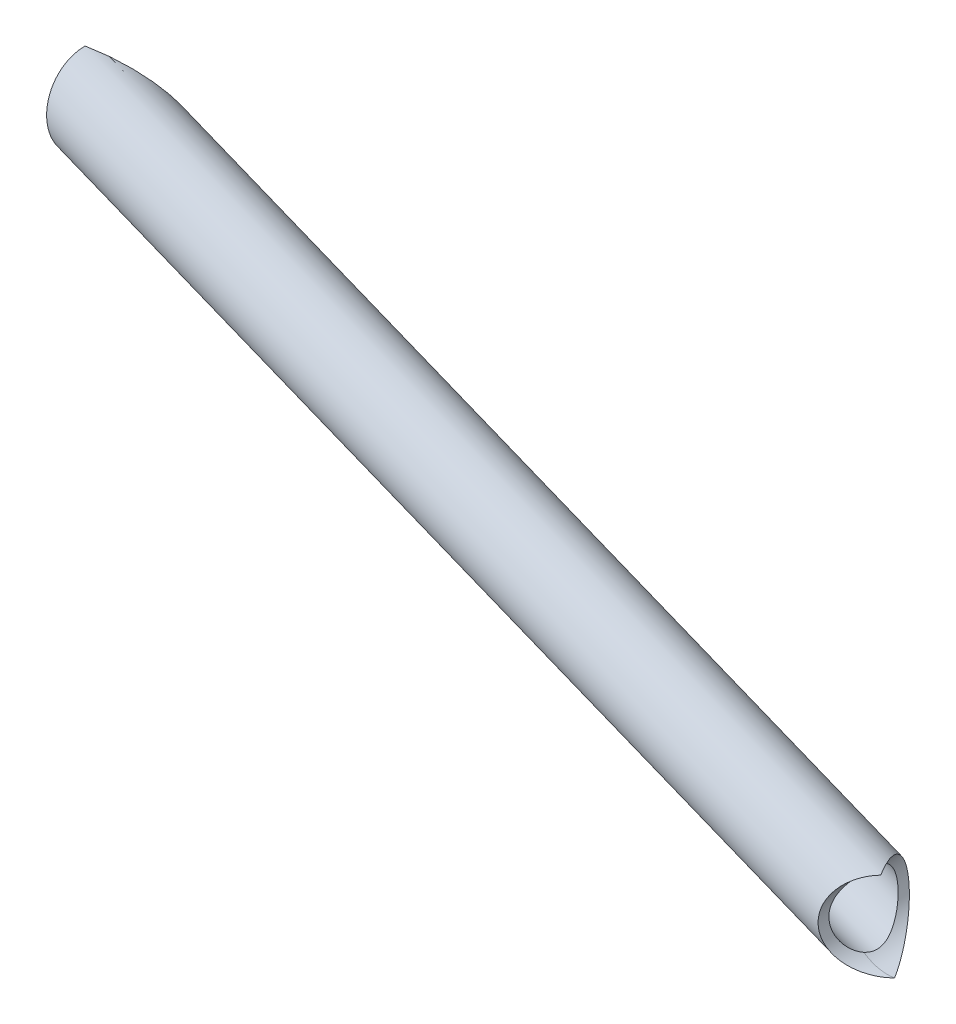
ISO-10303-21;
HEADER;
FILE_DESCRIPTION(('STEP AP214'),'2;1');
FILE_NAME('part.step','',(''),(''),'','','');
FILE_SCHEMA(('AUTOMOTIVE_DESIGN { 1 0 10303 214 1 1 1 1 }'));
ENDSEC;
DATA;
#1=APPLICATION_CONTEXT('core data for automotive mechanical design processes');
#2=APPLICATION_PROTOCOL_DEFINITION('international standard','automotive_design',2000,#1);
#3=PRODUCT_CONTEXT('',#1,'mechanical');
#4=PRODUCT('Part','Part','',(#3));
#5=PRODUCT_RELATED_PRODUCT_CATEGORY('part','',(#4));
#6=PRODUCT_DEFINITION_FORMATION('','',#4);
#7=PRODUCT_DEFINITION_CONTEXT('part definition',#1,'design');
#8=PRODUCT_DEFINITION('design','',#6,#7);
#9=PRODUCT_DEFINITION_SHAPE('','',#8);
#10=(LENGTH_UNIT() NAMED_UNIT(*) SI_UNIT(.MILLI.,.METRE.));
#11=(NAMED_UNIT(*) PLANE_ANGLE_UNIT() SI_UNIT($,.RADIAN.));
#12=(NAMED_UNIT(*) SI_UNIT($,.STERADIAN.) SOLID_ANGLE_UNIT());
#13=UNCERTAINTY_MEASURE_WITH_UNIT(LENGTH_MEASURE(1.E-05),#10,'distance_accuracy_value','');
#14=(GEOMETRIC_REPRESENTATION_CONTEXT(3) GLOBAL_UNCERTAINTY_ASSIGNED_CONTEXT((#13)) GLOBAL_UNIT_ASSIGNED_CONTEXT((#10,
#11,#12)) REPRESENTATION_CONTEXT('',''));
#15=CARTESIAN_POINT('',(0.,0.,0.));
#16=DIRECTION('',(0.,0.,1.));
#17=DIRECTION('',(1.,0.,0.));
#18=AXIS2_PLACEMENT_3D('',#15,#16,#17);
#19=CARTESIAN_POINT('',(900.,503.049546279118,167.449999999999));
#20=DIRECTION('',(-0.914545522624735,-0.155523085877016,-0.373388613653845));
#21=DIRECTION('',(-0.377987872602403,0.,0.925810546583646));
#22=AXIS2_PLACEMENT_3D('',#19,#20,#21);
#23=CYLINDRICAL_SURFACE('',#22,12.7);
#24=CARTESIAN_POINT('',(900.,503.049546279118,167.449999999999));
#25=DIRECTION('',(-0.816941933505309,-0.138925102510415,0.559737164366524));
#26=DIRECTION('',(-0.551815136060001,-0.0938389513377034,-0.828670203897137));
#27=AXIS2_PLACEMENT_3D('',#24,#25,#26);
#28=ELLIPSE('',#27,22.6892205994095,12.7);
#29=CARTESIAN_POINT('',(902.129132667718,490.52929092696,167.449999999999));
#30=VERTEX_POINT('',#29);
#31=CARTESIAN_POINT('',(897.870867332281,515.569801631277,167.449999999999));
#32=VERTEX_POINT('',#31);
#33=EDGE_CURVE('E87',#30,#32,#28,.F.);
#34=ORIENTED_EDGE('',*,*,#33,.F.);
#35=CARTESIAN_POINT('',(902.129132667718,490.52929092696,167.449999999999));
#36=CARTESIAN_POINT('',(902.122622527037,490.528183844689,167.454198455936));
#37=CARTESIAN_POINT('',(902.116111504246,490.527081459243,167.458396889795));
#38=CARTESIAN_POINT('',(901.661299132018,490.45041536341,167.751627534305));
#39=CARTESIAN_POINT('',(901.208847162959,490.397112413899,168.04054100451));
#40=CARTESIAN_POINT('',(900.299484677143,490.335760767951,168.616293994502));
#41=CARTESIAN_POINT('',(899.842572533139,490.32772925748,168.903132685398));
#42=CARTESIAN_POINT('',(898.926631418943,490.357934896545,169.473822874049));
#43=CARTESIAN_POINT('',(898.467600059604,490.396296410429,169.757664275964));
#44=CARTESIAN_POINT('',(897.552660406562,490.52075999025,170.319584412169));
#45=CARTESIAN_POINT('',(897.096750878394,490.606841932938,170.597665524278));
#46=CARTESIAN_POINT('',(896.283921842593,490.805769685706,171.090344072895));
#47=CARTESIAN_POINT('',(895.925668563482,490.90965400373,171.306384384694));
#48=CARTESIAN_POINT('',(895.216171297338,491.149540275628,171.732156637292));
#49=CARTESIAN_POINT('',(894.864927129832,491.285541401378,171.94188874059));
#50=CARTESIAN_POINT('',(894.172842247707,491.590176165168,172.353107853072));
#51=CARTESIAN_POINT('',(893.831983583372,491.758749311541,172.554609320319));
#52=CARTESIAN_POINT('',(893.163108244727,492.129355034394,172.947951310032));
#53=CARTESIAN_POINT('',(892.835089202271,492.33138140445,173.139793615926));
#54=CARTESIAN_POINT('',(892.254086847868,492.72908433124,173.477578121337));
#55=CARTESIAN_POINT('',(891.998378942181,492.919124407548,173.625483593816));
#56=CARTESIAN_POINT('',(891.4999444911,493.321753147347,173.912150115556));
#57=CARTESIAN_POINT('',(891.257215399974,493.534337364329,174.050912959349));
#58=CARTESIAN_POINT('',(890.786938932366,493.981808619295,174.317903503734));
#59=CARTESIAN_POINT('',(890.559391735893,494.216695921644,174.446131079414));
#60=CARTESIAN_POINT('',(890.121833183771,494.708139912072,174.690540454786));
#61=CARTESIAN_POINT('',(889.911822108782,494.964696946834,174.806722061695));
#62=CARTESIAN_POINT('',(889.510236955432,495.500401226087,175.026297197397));
#63=CARTESIAN_POINT('',(889.318813416184,495.779703855027,175.129587978495));
#64=CARTESIAN_POINT('',(888.95860792515,496.357569203389,175.320772835931));
#65=CARTESIAN_POINT('',(888.789826307408,496.65613220687,175.40866668512));
#66=CARTESIAN_POINT('',(888.477224114984,497.270110105648,175.567529235537));
#67=CARTESIAN_POINT('',(888.333387301978,497.585513861869,175.638508958702));
#68=CARTESIAN_POINT('',(888.072437140031,498.230598909394,175.762341295895));
#69=CARTESIAN_POINT('',(887.955319983527,498.560278158459,175.815196493217));
#70=CARTESIAN_POINT('',(887.762409272802,499.187798586848,175.89627615038));
#71=CARTESIAN_POINT('',(887.683245575699,499.484315569086,175.926786943619));
#72=CARTESIAN_POINT('',(887.546899187133,500.083481602296,175.972885213894));
#73=CARTESIAN_POINT('',(887.489714330709,500.386130046214,175.988474160989));
#74=CARTESIAN_POINT('',(887.397593601685,500.995121831296,176.004540111915));
#75=CARTESIAN_POINT('',(887.362653553058,501.301464467938,176.005019953005));
#76=CARTESIAN_POINT('',(887.314929652733,501.915520464499,175.990916470395));
#77=CARTESIAN_POINT('',(887.302145963986,502.223233834482,175.976333035913));
#78=CARTESIAN_POINT('',(887.29842517406,502.82565048861,175.93322311519));
#79=CARTESIAN_POINT('',(887.306650429231,503.120390442243,175.905266258473));
#80=CARTESIAN_POINT('',(887.342624992098,503.707082390096,175.836075759905));
#81=CARTESIAN_POINT('',(887.370373506881,503.999034497053,175.794842657288));
#82=CARTESIAN_POINT('',(887.444647974888,504.578437265887,175.699612322176));
#83=CARTESIAN_POINT('',(887.491175222671,504.865887616004,175.645614209797));
#84=CARTESIAN_POINT('',(887.602129826446,505.434739926397,175.525464868647));
#85=CARTESIAN_POINT('',(887.666559078194,505.716141242701,175.45931235302));
#86=CARTESIAN_POINT('',(887.817865353703,506.29252311627,175.310097862798));
#87=CARTESIAN_POINT('',(887.906071350084,506.586921595353,175.226135532974));
#88=CARTESIAN_POINT('',(888.100808217771,507.165680403899,175.045839560192));
#89=CARTESIAN_POINT('',(888.207339802163,507.450040342223,174.949505435859));
#90=CARTESIAN_POINT('',(888.437457923756,508.007553820313,174.745376245834));
#91=CARTESIAN_POINT('',(888.561046744315,508.280705853378,174.637579646168));
#92=CARTESIAN_POINT('',(888.824037826602,508.814857363497,174.411425357395));
#93=CARTESIAN_POINT('',(888.96344592924,509.075852301322,174.293063770872));
#94=CARTESIAN_POINT('',(889.277309284251,509.620331604221,174.029503350167));
#95=CARTESIAN_POINT('',(889.453940293249,509.901868947411,173.882864714691));
#96=CARTESIAN_POINT('',(889.824380945655,510.447063200639,173.578366631511));
#97=CARTESIAN_POINT('',(890.018197061927,510.710713306786,173.420502960308));
#98=CARTESIAN_POINT('',(890.623025880253,511.473687796183,172.931887315737));
#99=CARTESIAN_POINT('',(891.057494571499,511.945165582597,172.586047418827));
#100=CARTESIAN_POINT('',(892.048749340857,512.876593746906,171.807065483814));
#101=CARTESIAN_POINT('',(892.614027407438,513.32308335057,171.36874556503));
#102=CARTESIAN_POINT('',(893.795916698795,514.105727293516,170.463901611869));
#103=CARTESIAN_POINT('',(894.412528096342,514.441881261426,169.997377482567));
#104=CARTESIAN_POINT('',(895.499277982196,514.920119523027,169.18519795424));
#105=CARTESIAN_POINT('',(895.960355441554,515.090214064727,168.843499306014));
#106=CARTESIAN_POINT('',(896.896339096839,515.3720931315,168.156052534914));
#107=CARTESIAN_POINT('',(897.371223250566,515.483965732568,167.81031134242));
#108=CARTESIAN_POINT('',(897.857378162866,515.567501754868,167.459725628872));
#109=CARTESIAN_POINT('',(897.86412230349,515.568654611534,167.454862809429));
#110=CARTESIAN_POINT('',(897.870867332281,515.569801631277,167.449999999999));
#111=B_SPLINE_CURVE_WITH_KNOTS('',3,(#35,#36,#37,#38,#39,#40,#41,#42,#43,#44,#45,#46,#47,#48,
#49,#50,#51,#52,#53,#54,#55,#56,#57,#58,#59,#60,#61,#62,#63,#64,#65,#66,#67,#68,#69,#70,#71,#72,
#73,#74,#75,#76,#77,#78,#79,#80,#81,#82,#83,#84,#85,#86,#87,#88,#89,#90,#91,#92,#93,#94,#95,#96,
#97,#98,#99,#100,#101,#102,#103,#104,#105,#106,#107,#108,#109,#110),.UNSPECIFIED.,.F.,.F.,(4,2,
2,2,2,2,2,2,2,2,2,2,2,2,2,2,2,2,2,2,2,2,2,2,2,2,2,2,2,2,2,2,2,2,2,2,2,4),(0.,0.0234759311194202,
1.63963604782687,3.25640965072118,4.87752691239777,6.49796108383418,7.78994422334894,
9.08189405307033,10.3714671864165,11.6608013386846,12.7135619076379,13.7661152194769,
14.8186810090961,15.8712636413793,16.9317625084439,17.9922770196716,19.0520985548112,
20.1117689704603,21.0358418001486,21.9598235833632,22.8836318558748,23.8074469225797,
24.6950084902585,25.5825340128319,26.4701207297598,27.357801474689,28.3126018825566,
29.2674394520615,30.2224049646076,31.1777242308237,32.2664105191893,33.355508623433,
35.5332220114024,38.0532389822262,40.5732644349785,42.3663045735679,44.1566243247933,
44.1818063663016),.UNSPECIFIED.);
#112=EDGE_CURVE('E88',#32,#30,#111,.F.);
#113=ORIENTED_EDGE('',*,*,#112,.F.);
#114=EDGE_LOOP('',(#34,#113));
#115=FACE_BOUND('',#114,.T.);
#116=CARTESIAN_POINT('',(489.862566335555,433.303603907535,-2.27595720048157E-12));
#117=DIRECTION('',(0.,0.,-1.));
#118=DIRECTION('',(-0.985846878122719,-0.16764824155263,0.));
#119=AXIS2_PLACEMENT_3D('',#116,#117,#118);
#120=ELLIPSE('',#119,34.0128207866932,12.7);
#121=CARTESIAN_POINT('',(487.733433667837,445.823859259693,-2.27595720048157E-12));
#122=VERTEX_POINT('',#121);
#123=CARTESIAN_POINT('',(491.991699003274,420.783348555376,-2.27595720048157E-12));
#124=VERTEX_POINT('',#123);
#125=EDGE_CURVE('E11',#122,#124,#120,.T.);
#126=ORIENTED_EDGE('',*,*,#125,.F.);
#127=CARTESIAN_POINT('',(489.862566335555,433.303603907535,-2.27595720048157E-12));
#128=DIRECTION('',(-0.985846878122719,-0.16764824155263,0.));
#129=DIRECTION('',(0.,0.,-1.));
#130=AXIS2_PLACEMENT_3D('',#127,#128,#129);
#131=ELLIPSE('',#130,13.6901390279901,12.7);
#132=EDGE_CURVE('E52',#124,#122,#131,.T.);
#133=ORIENTED_EDGE('',*,*,#132,.F.);
#134=EDGE_LOOP('',(#126,#133));
#135=FACE_BOUND('',#134,.T.);
#136=ADVANCED_FACE('F42',(#115,#135),#23,.T.);
#137=CARTESIAN_POINT('',(900.,420.499546279117,167.449999999999));
#138=DIRECTION('',(-1.,0.,0.));
#139=DIRECTION('',(0.,0.,1.));
#140=AXIS2_PLACEMENT_3D('',#137,#138,#139);
#141=TOROIDAL_SURFACE('',#140,82.5500000000008,12.7);
#142=CARTESIAN_POINT('',(900.,503.049546279118,167.449999999999));
#143=DIRECTION('',(0.,0.,-1.));
#144=DIRECTION('',(-1.,0.,0.));
#145=AXIS2_PLACEMENT_3D('',#142,#143,#144);
#146=CIRCLE('',#145,12.7);
#147=CARTESIAN_POINT('',(889.707055664031,510.488988253933,167.449999999999));
#148=VERTEX_POINT('',#147);
#149=EDGE_CURVE('E79',#148,#32,#146,.T.);
#150=ORIENTED_EDGE('',*,*,#149,.T.);
#151=ORIENTED_EDGE('',*,*,#112,.T.);
#152=CARTESIAN_POINT('',(892.744756187759,492.62594626641,167.449999999999));
#153=VERTEX_POINT('',#152);
#154=EDGE_CURVE('E82',#30,#153,#146,.T.);
#155=ORIENTED_EDGE('',*,*,#154,.T.);
#156=CARTESIAN_POINT('',(889.707121764974,510.489079707743,167.449799999999));
#157=CARTESIAN_POINT('',(889.67008511259,510.437838400286,167.561869968516));
#158=CARTESIAN_POINT('',(889.631870926055,510.383952087896,167.672307172637));
#159=CARTESIAN_POINT('',(889.553497677238,510.27108768359,167.8898056604));
#160=CARTESIAN_POINT('',(889.513339065407,510.21211076852,167.996867716538));
#161=CARTESIAN_POINT('',(889.390670662329,510.02800755622,168.312553010159));
#162=CARTESIAN_POINT('',(889.30584295024,509.895537794002,168.516047155908));
#163=CARTESIAN_POINT('',(889.133652971057,509.613471622576,168.907777024132));
#164=CARTESIAN_POINT('',(889.046305582128,509.463964620117,169.096084282118));
#165=CARTESIAN_POINT('',(888.871424254841,509.14875938673,169.458641236342));
#166=CARTESIAN_POINT('',(888.783890258369,508.983055046362,169.632885582626));
#167=CARTESIAN_POINT('',(888.611594863405,508.637827478004,169.966441441058));
#168=CARTESIAN_POINT('',(888.526821456761,508.458380235158,170.125825593605));
#169=CARTESIAN_POINT('',(888.36172064306,508.086227707166,170.430751024282));
#170=CARTESIAN_POINT('',(888.281392696442,507.893524037398,170.576293983916));
#171=CARTESIAN_POINT('',(888.126934261045,507.495733598871,170.853814686475));
#172=CARTESIAN_POINT('',(888.052813799435,507.290627682644,170.985770557687));
#173=CARTESIAN_POINT('',(887.912594507022,506.869489767067,171.235812467442));
#174=CARTESIAN_POINT('',(887.846496347657,506.653456855308,171.353897345007));
#175=CARTESIAN_POINT('',(887.717714013774,506.189611889411,171.587150975649));
#176=CARTESIAN_POINT('',(887.656029655031,505.940780492514,171.700851357647));
#177=CARTESIAN_POINT('',(887.546002308917,505.433066302126,171.91101385785));
#178=CARTESIAN_POINT('',(887.497660098884,505.174182923989,172.007474971549));
#179=CARTESIAN_POINT('',(887.415912003329,504.648321341008,172.182757511855));
#180=CARTESIAN_POINT('',(887.382499922925,504.381346542688,172.261586247782));
#181=CARTESIAN_POINT('',(887.331921848897,503.841222956981,172.401263217537));
#182=CARTESIAN_POINT('',(887.314754941307,503.568074517814,172.462112462771));
#183=CARTESIAN_POINT('',(887.297993122068,503.026391777352,172.563857815952));
#184=CARTESIAN_POINT('',(887.297865828654,502.757980046967,172.605318057343));
#185=CARTESIAN_POINT('',(887.314535142293,502.219546541041,172.67077154422));
#186=CARTESIAN_POINT('',(887.331331529629,501.949524786448,172.694765016464));
#187=CARTESIAN_POINT('',(887.382205107885,501.410204636176,172.725129786164));
#188=CARTESIAN_POINT('',(887.416276539668,501.140906029474,172.731506951959));
#189=CARTESIAN_POINT('',(887.501712961963,500.605232452332,172.726643353113));
#190=CARTESIAN_POINT('',(887.553077016702,500.338857324497,172.715403541676));
#191=CARTESIAN_POINT('',(887.668670965838,499.829226046247,172.676809959621));
#192=CARTESIAN_POINT('',(887.731788967836,499.585629199174,172.650603473759));
#193=CARTESIAN_POINT('',(887.872161910616,499.104668626731,172.583243387153));
#194=CARTESIAN_POINT('',(887.949416105228,498.867304573123,172.54209057523));
#195=CARTESIAN_POINT('',(888.117210365357,498.40046249658,172.445170197452));
#196=CARTESIAN_POINT('',(888.207747196615,498.170982570639,172.389406186764));
#197=CARTESIAN_POINT('',(888.401053071856,497.721267499313,172.263640929023));
#198=CARTESIAN_POINT('',(888.50382238152,497.501032554862,172.193639372718));
#199=CARTESIAN_POINT('',(888.720701208146,497.070264308765,172.039530883197));
#200=CARTESIAN_POINT('',(888.834850136311,496.859768700349,171.955374182614));
#201=CARTESIAN_POINT('',(889.07269736572,496.450352008834,171.773524906689));
#202=CARTESIAN_POINT('',(889.196395703014,496.251430969436,171.675832280246));
#203=CARTESIAN_POINT('',(889.451867103633,495.865717566726,171.467093699098));
#204=CARTESIAN_POINT('',(889.583651028092,495.678942243739,171.356029581369));
#205=CARTESIAN_POINT('',(889.853310184359,495.31845806957,171.120872139577));
#206=CARTESIAN_POINT('',(889.991185549313,495.144749504226,170.996778530635));
#207=CARTESIAN_POINT('',(890.282325478391,494.797388188149,170.725066561243));
#208=CARTESIAN_POINT('',(890.435933233347,494.624874508767,170.576357504072));
#209=CARTESIAN_POINT('',(890.745064943452,494.296129406211,170.263611352127));
#210=CARTESIAN_POINT('',(890.900589316018,494.139901602577,170.099570865238));
#211=CARTESIAN_POINT('',(891.209735360029,493.844596846178,169.756270733527));
#212=CARTESIAN_POINT('',(891.363361294627,493.705470598083,169.577057472524));
#213=CARTESIAN_POINT('',(891.665147214922,493.444296629812,169.20249847375));
#214=CARTESIAN_POINT('',(891.813310196045,493.322239444684,169.007161772905));
#215=CARTESIAN_POINT('',(892.102279375522,493.093360888919,168.595657744687));
#216=CARTESIAN_POINT('',(892.242892565157,492.986872668086,168.379165417414));
#217=CARTESIAN_POINT('',(892.441498029712,492.841047194101,168.040952431166));
#218=CARTESIAN_POINT('',(892.505708717826,492.794714975542,167.925840366526));
#219=CARTESIAN_POINT('',(892.629197261375,492.706750232598,167.691145682434));
#220=CARTESIAN_POINT('',(892.688471544189,492.665121104341,167.571559914399));
#221=CARTESIAN_POINT('',(892.744848802594,492.625881803102,167.449799999999));
#222=B_SPLINE_CURVE_WITH_KNOTS('',3,(#156,#157,#158,#159,#160,#161,#162,#163,#164,#165,#166,
#167,#168,#169,#170,#171,#172,#173,#174,#175,#176,#177,#178,#179,#180,#181,#182,#183,#184,#185,
#186,#187,#188,#189,#190,#191,#192,#193,#194,#195,#196,#197,#198,#199,#200,#201,#202,#203,#204,
#205,#206,#207,#208,#209,#210,#211,#212,#213,#214,#215,#216,#217,#218,#219,#220,#221),
.UNSPECIFIED.,.F.,.F.,(4,2,2,2,2,2,2,2,2,2,2,2,2,2,2,2,2,2,2,2,2,2,2,2,2,2,2,2,2,2,2,2,4),(0.,
0.385927151135696,0.771765321265045,1.54216325141601,2.30868991508118,3.07550682730649,
3.83835374748479,4.60110787411809,5.36507124924067,6.12909852134163,6.96941066299186,
7.80977175240325,8.64978383056243,9.48974864624745,10.303463469471,11.1171677285962,
11.9306008940799,12.7439900484887,13.5020889044225,14.2601477560613,15.0180223294308,
15.7759133662775,16.5365269732377,17.2971434517919,18.058805016401,18.8204832375353,
19.643718078679,20.4671354956616,21.2881207923811,22.1086490246216,22.9447510527091,
23.363687457079,23.7829244698475),.UNSPECIFIED.);
#223=EDGE_CURVE('E76',#148,#153,#222,.T.);
#224=ORIENTED_EDGE('',*,*,#223,.F.);
#225=EDGE_LOOP('',(#150,#151,#155,#224));
#226=FACE_BOUND('',#225,.T.);
#227=ADVANCED_FACE('F78',(#226),#141,.F.);
#228=CARTESIAN_POINT('',(900.,503.049546279118,167.449999999999));
#229=DIRECTION('',(0.,0.,-1.));
#230=DIRECTION('',(-1.,0.,0.));
#231=AXIS2_PLACEMENT_3D('',#228,#229,#230);
#232=CYLINDRICAL_SURFACE('',#231,12.7);
#233=ORIENTED_EDGE('',*,*,#154,.F.);
#234=ORIENTED_EDGE('',*,*,#33,.T.);
#235=ORIENTED_EDGE('',*,*,#149,.F.);
#236=CARTESIAN_POINT('',(887.391748247447,501.525739288637,172.725629836838));
#237=CARTESIAN_POINT('',(887.422507809845,501.271227086945,172.738188507595));
#238=CARTESIAN_POINT('',(887.461032357995,501.01726638347,172.742853874987));
#239=CARTESIAN_POINT('',(887.553374172634,500.512349291848,172.736363748303));
#240=CARTESIAN_POINT('',(887.607191116358,500.261392840409,172.72520858812));
#241=CARTESIAN_POINT('',(887.729595903643,499.764321291795,172.687161663404));
#242=CARTESIAN_POINT('',(887.798184056515,499.518206296119,172.660269569318));
#243=CARTESIAN_POINT('',(887.949339146732,499.032550735458,172.590942868691));
#244=CARTESIAN_POINT('',(888.03190621441,498.793010231796,172.54850811723));
#245=CARTESIAN_POINT('',(888.209797069173,498.322578700214,172.448485002969));
#246=CARTESIAN_POINT('',(888.305093474673,498.091670431655,172.390928917058));
#247=CARTESIAN_POINT('',(888.507344035722,497.639348738015,172.260958693294));
#248=CARTESIAN_POINT('',(888.614298178502,497.417935302534,172.188544571714));
#249=CARTESIAN_POINT('',(888.838483642341,496.985732834522,172.029194320065));
#250=CARTESIAN_POINT('',(888.955717441454,496.774946383165,171.94225468382));
#251=CARTESIAN_POINT('',(889.198879295757,496.365042954308,171.754199991029));
#252=CARTESIAN_POINT('',(889.324807557176,496.165926253814,171.653084598185));
#253=CARTESIAN_POINT('',(889.588932193971,495.772314713037,171.432548034823));
#254=CARTESIAN_POINT('',(889.727419386818,495.578338896465,171.312548794346));
#255=CARTESIAN_POINT('',(890.00988010488,495.204652065362,171.057693454642));
#256=CARTESIAN_POINT('',(890.153853999096,495.024942012768,170.922836355013));
#257=CARTESIAN_POINT('',(890.445043510564,494.680333962115,170.638270688677));
#258=CARTESIAN_POINT('',(890.592260603071,494.515442885623,170.488555250011));
#259=CARTESIAN_POINT('',(890.887284268931,494.201108378058,170.174245304981));
#260=CARTESIAN_POINT('',(891.035090776406,494.051663268219,170.009652419244));
#261=CARTESIAN_POINT('',(891.311605730341,493.784860673694,169.685021355621));
#262=CARTESIAN_POINT('',(891.44056826495,493.665787690161,169.526607948409));
#263=CARTESIAN_POINT('',(891.694305903732,493.440476466362,169.197711727309));
#264=CARTESIAN_POINT('',(891.819080997294,493.334238258618,169.027228882842));
#265=CARTESIAN_POINT('',(892.061578090449,493.135110322839,168.674303708937));
#266=CARTESIAN_POINT('',(892.179310039079,493.042201493295,168.491879050142));
#267=CARTESIAN_POINT('',(892.404886019399,492.869940110478,168.114908204068));
#268=CARTESIAN_POINT('',(892.512732481348,492.790584221171,167.920365015881));
#269=CARTESIAN_POINT('',(892.69571139016,492.659768961861,167.558366203399));
#270=CARTESIAN_POINT('',(892.773137624438,492.605882368504,167.392944497937));
#271=CARTESIAN_POINT('',(892.917745695898,492.507282050377,167.055052841455));
#272=CARTESIAN_POINT('',(892.984929816884,492.462566279911,166.882584472619));
#273=CARTESIAN_POINT('',(893.107456641245,492.382390550169,166.531623223232));
#274=CARTESIAN_POINT('',(893.162813069603,492.346919852183,166.353137606818));
#275=CARTESIAN_POINT('',(893.260588679331,492.285082079779,165.991107001709));
#276=CARTESIAN_POINT('',(893.303007768464,492.258715070268,165.807561976952));
#277=CARTESIAN_POINT('',(893.374225888216,492.214839414525,165.43673509255));
#278=CARTESIAN_POINT('',(893.403019493805,492.197334296491,165.24945177537));
#279=CARTESIAN_POINT('',(893.446850173174,492.170810922791,164.872705292186));
#280=CARTESIAN_POINT('',(893.461887276453,492.161792648927,164.683242130857));
#281=CARTESIAN_POINT('',(893.478656509395,492.151740394171,164.303358733076));
#282=CARTESIAN_POINT('',(893.48037599758,492.150713999403,164.112937758922));
#283=CARTESIAN_POINT('',(893.471357420701,492.156115270638,163.732479160727));
#284=CARTESIAN_POINT('',(893.460615538174,492.162545220845,163.542441672034));
#285=CARTESIAN_POINT('',(893.420284574977,492.186850355667,163.076940739934));
#286=CARTESIAN_POINT('',(893.3843157173,492.208619314958,162.802225280082));
#287=CARTESIAN_POINT('',(893.292182422369,492.265388315617,162.257597583221));
#288=CARTESIAN_POINT('',(893.236007701561,492.300395094696,161.987687865584));
#289=CARTESIAN_POINT('',(893.106977052367,492.382676951284,161.45287005017));
#290=CARTESIAN_POINT('',(893.034065162668,492.429993258527,161.187982033853));
#291=CARTESIAN_POINT('',(892.874921593875,492.536107420122,160.664650790592));
#292=CARTESIAN_POINT('',(892.788690501205,492.594904769012,160.406207280488));
#293=CARTESIAN_POINT('',(892.624987968737,492.70996303891,159.949999848184));
#294=CARTESIAN_POINT('',(892.549527494635,492.764125183132,159.750974052673));
#295=CARTESIAN_POINT('',(892.393088005877,492.879279363254,159.357102057013));
#296=CARTESIAN_POINT('',(892.312108388179,492.940272145966,159.16225631666));
#297=CARTESIAN_POINT('',(892.062262172523,493.133567235948,158.583900853917));
#298=CARTESIAN_POINT('',(891.886539665976,493.276151080477,158.206712520718));
#299=CARTESIAN_POINT('',(891.523241085339,493.589516791053,157.470650829774));
#300=CARTESIAN_POINT('',(891.335673264066,493.760279155601,157.111765028704));
#301=CARTESIAN_POINT('',(890.953582818782,494.131958925234,156.414025912199));
#302=CARTESIAN_POINT('',(890.759064542891,494.332857720497,156.0751604126));
#303=CARTESIAN_POINT('',(890.432718229692,494.695193903927,155.529528317995));
#304=CARTESIAN_POINT('',(890.301550172659,494.847542618463,155.316301519872));
#305=CARTESIAN_POINT('',(890.039520175467,495.167816388646,154.901609483533));
#306=CARTESIAN_POINT('',(889.908658238427,495.335741602277,154.700144364643));
#307=CARTESIAN_POINT('',(889.64901682159,495.687829362649,154.311193396801));
#308=CARTESIAN_POINT('',(889.520234049807,495.871962476599,154.123683304423));
#309=CARTESIAN_POINT('',(889.266366346894,496.257460177636,153.76475317242));
#310=CARTESIAN_POINT('',(889.141280223247,496.458819124299,153.593327904241));
#311=CARTESIAN_POINT('',(888.840109348596,496.977205751493,153.194344358851));
#312=CARTESIAN_POINT('',(888.667182866267,497.304670903765,152.977475184358));
#313=CARTESIAN_POINT('',(888.423165008414,497.824265056096,152.691605910152));
#314=CARTESIAN_POINT('',(888.344399188734,498.002164798994,152.602899718656));
#315=CARTESIAN_POINT('',(888.193054290885,498.367132756224,152.440148891822));
#316=CARTESIAN_POINT('',(888.120474122675,498.554199345974,152.36610167021));
#317=CARTESIAN_POINT('',(887.994001139313,498.905286251494,152.245108314629));
#318=CARTESIAN_POINT('',(887.93899455761,499.068063489711,152.195709818075));
#319=CARTESIAN_POINT('',(887.834841238723,499.398665870607,152.109182129323));
#320=CARTESIAN_POINT('',(887.785693344339,499.566490008201,152.072050511613));
#321=CARTESIAN_POINT('',(887.693901994512,499.906158909981,152.010794575845));
#322=CARTESIAN_POINT('',(887.65125525067,500.07800159044,151.986663666037));
#323=CARTESIAN_POINT('',(887.572957274896,500.424631817434,151.951890963221));
#324=CARTESIAN_POINT('',(887.537306119776,500.599419396281,151.941249318322));
#325=CARTESIAN_POINT('',(887.473312963667,500.950954495013,151.933685322012));
#326=CARTESIAN_POINT('',(887.444984450641,501.127705014971,151.936788099267));
#327=CARTESIAN_POINT('',(887.395910687517,501.481481734953,151.956700313217));
#328=CARTESIAN_POINT('',(887.375165459978,501.658507935796,151.973509790687));
#329=CARTESIAN_POINT('',(887.341245010061,502.011572366534,152.020476418756));
#330=CARTESIAN_POINT('',(887.328072788248,502.187610177493,152.050638851676));
#331=CARTESIAN_POINT('',(887.309120978138,502.537415440387,152.123689495969));
#332=CARTESIAN_POINT('',(887.303341539377,502.711182846327,152.166577964734));
#333=CARTESIAN_POINT('',(887.29886802536,503.052876340702,152.263553210117));
#334=CARTESIAN_POINT('',(887.300070915269,503.220850760697,152.317465871642));
#335=CARTESIAN_POINT('',(887.308888843496,503.552834625752,152.435989608102));
#336=CARTESIAN_POINT('',(887.316505890181,503.716842812379,152.500604028823));
#337=CARTESIAN_POINT('',(887.34823865028,504.201855167958,152.709079466827));
#338=CARTESIAN_POINT('',(887.381234683965,504.516021667352,152.867623651888));
#339=CARTESIAN_POINT('',(887.493194986359,505.311633396405,153.325140155141));
#340=CARTESIAN_POINT('',(887.587979490826,505.775866328229,153.650193186642));
#341=CARTESIAN_POINT('',(887.755647959707,506.428393463023,154.182438088262));
#342=CARTESIAN_POINT('',(887.815931394525,506.638973368752,154.367710187823));
#343=CARTESIAN_POINT('',(887.943273695504,507.045886266123,154.751214154267));
#344=CARTESIAN_POINT('',(888.010332220401,507.242219974496,154.949445368217));
#345=CARTESIAN_POINT('',(888.183045837875,507.712053533998,155.45514591085));
#346=CARTESIAN_POINT('',(888.291750064781,507.977241649601,155.769292382752));
#347=CARTESIAN_POINT('',(888.515498667426,508.478312110986,156.418179365104));
#348=CARTESIAN_POINT('',(888.63054676991,508.714176960089,156.752931994487));
#349=CARTESIAN_POINT('',(888.862318998036,509.157294654533,157.440602622702));
#350=CARTESIAN_POINT('',(888.979044169845,509.364528700842,157.793532349862));
#351=CARTESIAN_POINT('',(889.209073186897,509.750007592942,158.515784801085));
#352=CARTESIAN_POINT('',(889.32237860617,509.928265946505,158.885099783931));
#353=CARTESIAN_POINT('',(889.506416898931,510.204489348538,159.523874142356));
#354=CARTESIAN_POINT('',(889.579556804201,510.310321227577,159.78925774993));
#355=CARTESIAN_POINT('',(889.719016631767,510.506479651688,160.327520109598));
#356=CARTESIAN_POINT('',(889.785336215836,510.596805427946,160.600399232552));
#357=CARTESIAN_POINT('',(889.908190943199,510.760306687152,161.152735686703));
#358=CARTESIAN_POINT('',(889.964748354585,510.833521340459,161.432176349652));
#359=CARTESIAN_POINT('',(890.064933492275,510.960997075915,161.997635354888));
#360=CARTESIAN_POINT('',(890.108566658149,511.015266133627,162.283650875166));
#361=CARTESIAN_POINT('',(890.168452940393,511.088961248926,162.773321636147));
#362=CARTESIAN_POINT('',(890.188996866831,511.113963555245,162.975615970888));
#363=CARTESIAN_POINT('',(890.220713213514,511.152396578582,163.382010057824));
#364=CARTESIAN_POINT('',(890.231888726657,511.165831114634,163.586109191675));
#365=CARTESIAN_POINT('',(890.243691846539,511.180016381857,163.994793252976));
#366=CARTESIAN_POINT('',(890.244334647561,511.180785384086,164.199377054755));
#367=CARTESIAN_POINT('',(890.234233230751,511.168651414592,164.6078860796));
#368=CARTESIAN_POINT('',(890.223489361528,511.155748861431,164.811811322636));
#369=CARTESIAN_POINT('',(890.190094249479,511.115303785451,165.218939522297));
#370=CARTESIAN_POINT('',(890.167346483871,511.087642568591,165.422122981025));
#371=CARTESIAN_POINT('',(890.110156750172,511.017171509798,165.824177910326));
#372=CARTESIAN_POINT('',(890.075714752598,510.974361629674,166.023049370028));
#373=CARTESIAN_POINT('',(889.996071055564,510.873581016885,166.414861779757));
#374=CARTESIAN_POINT('',(889.950860961843,510.815598452868,166.60779796979));
#375=CARTESIAN_POINT('',(889.851230717434,510.684938826345,166.986147601369));
#376=CARTESIAN_POINT('',(889.796810428833,510.612261543797,167.171560930216));
#377=CARTESIAN_POINT('',(889.68620646915,510.460591321104,167.516532636032));
#378=CARTESIAN_POINT('',(889.630689818906,510.382868166849,167.676867338493));
#379=CARTESIAN_POINT('',(889.515130852974,510.216679714694,167.990193960696));
#380=CARTESIAN_POINT('',(889.455086864969,510.128210439922,168.143183132637));
#381=CARTESIAN_POINT('',(889.270374447396,509.847706167312,168.590774580145));
#382=CARTESIAN_POINT('',(889.141072704046,509.640504800504,168.874157460479));
#383=CARTESIAN_POINT('',(888.932586111129,509.280676419116,169.303701208481));
#384=CARTESIAN_POINT('',(888.853901235294,509.139076296238,169.45964667874));
#385=CARTESIAN_POINT('',(888.697766316238,508.844138874717,169.760777190185));
#386=CARTESIAN_POINT('',(888.620316384533,508.690800523284,169.905961263887));
#387=CARTESIAN_POINT('',(888.468328763998,508.373227917562,170.185755715587));
#388=CARTESIAN_POINT('',(888.393793108374,508.208986264522,170.320358775414));
#389=CARTESIAN_POINT('',(888.249169753929,507.870527935581,170.579010744368));
#390=CARTESIAN_POINT('',(888.179082352896,507.696310593339,170.70305894709));
#391=CARTESIAN_POINT('',(888.030180277459,507.300113232321,170.966273371896));
#392=CARTESIAN_POINT('',(887.952744579978,507.075937199503,171.102928078891));
#393=CARTESIAN_POINT('',(887.808510118848,506.615468986994,171.360606987992));
#394=CARTESIAN_POINT('',(887.741712778549,506.379175191598,171.481629098138));
#395=CARTESIAN_POINT('',(887.620593334909,505.896003505302,171.707791813468));
#396=CARTESIAN_POINT('',(887.566271518076,505.649125371479,171.812932053896));
#397=CARTESIAN_POINT('',(887.471697261533,505.146454954585,172.006965574633));
#398=CARTESIAN_POINT('',(887.431443788056,504.890663328013,172.095860048482));
#399=CARTESIAN_POINT('',(887.367443476109,504.380809412165,172.254242618065));
#400=CARTESIAN_POINT('',(887.343180666129,504.126985478102,172.324289009267));
#401=CARTESIAN_POINT('',(887.309972843708,503.61447518882,172.448452577073));
#402=CARTESIAN_POINT('',(887.30102758769,503.355788910987,172.502570006966));
#403=CARTESIAN_POINT('',(887.299139989228,502.835569042726,172.594505450677));
#404=CARTESIAN_POINT('',(887.306191669218,502.574036552184,172.632329546531));
#405=CARTESIAN_POINT('',(887.336671848154,502.050054513929,172.691430784887));
#406=CARTESIAN_POINT('',(887.360099963944,501.787604987815,172.712708314503));
#407=CARTESIAN_POINT('',(887.391748247447,501.525739288637,172.725629836838));
#408=B_SPLINE_CURVE_WITH_KNOTS('',3,(#236,#237,#238,#239,#240,#241,#242,#243,#244,#245,#246,
#247,#248,#249,#250,#251,#252,#253,#254,#255,#256,#257,#258,#259,#260,#261,#262,#263,#264,#265,
#266,#267,#268,#269,#270,#271,#272,#273,#274,#275,#276,#277,#278,#279,#280,#281,#282,#283,#284,
#285,#286,#287,#288,#289,#290,#291,#292,#293,#294,#295,#296,#297,#298,#299,#300,#301,#302,#303,
#304,#305,#306,#307,#308,#309,#310,#311,#312,#313,#314,#315,#316,#317,#318,#319,#320,#321,#322,
#323,#324,#325,#326,#327,#328,#329,#330,#331,#332,#333,#334,#335,#336,#337,#338,#339,#340,#341,
#342,#343,#344,#345,#346,#347,#348,#349,#350,#351,#352,#353,#354,#355,#356,#357,#358,#359,#360,
#361,#362,#363,#364,#365,#366,#367,#368,#369,#370,#371,#372,#373,#374,#375,#376,#377,#378,#379,
#380,#381,#382,#383,#384,#385,#386,#387,#388,#389,#390,#391,#392,#393,#394,#395,#396,#397,#398,
#399,#400,#401,#402,#403,#404,#405,#406,#407),.UNSPECIFIED.,.T.,.F.,(4,2,2,2,2,2,2,2,2,2,2,2,2,
2,2,2,2,2,2,2,2,2,2,2,2,2,2,2,2,2,2,2,2,2,2,2,2,2,2,2,2,2,2,2,2,2,2,2,2,2,2,2,2,2,2,2,2,2,2,2,2,
2,2,2,2,2,2,2,2,2,2,2,2,2,2,2,2,2,2,2,2,2,2,2,2,4),(0.,0.769770168203888,1.53952409065217,
2.30929413337286,3.07907135355653,3.84721862834658,4.61536506186494,5.38369717952553,
6.15204752780055,6.95170952293795,7.75142539342717,8.55151287037765,9.35151329717186,
10.0601934656383,10.7688754296997,11.4765314580838,12.1840130463129,12.7547257995289,
13.3253111075095,13.8952306623452,14.4651542803725,15.0353046247612,15.6054537465149,
16.1761440045883,16.7470091362344,17.5793951819188,18.4122054622121,19.2478419115659,
20.0834415796691,20.7421214695856,21.4008734450442,22.718834648195,24.0358875266263,
25.3521304224797,26.2307369008382,27.1093522914189,27.9864038361696,28.863169290479,
30.1452819425368,30.7861311551853,31.4268672021316,31.9626678072229,32.4983624057375,
33.033785134772,33.5692137425473,34.1056216678684,34.6420311889359,35.1786530991894,
35.7152858637122,36.2440201262261,36.772920004744,37.8301794640667,39.5436976838187,
40.403882357886,41.2640237257743,42.5379291794752,43.81259113876,45.0880861053842,
46.3629847508809,47.2472556516988,48.1315703831947,49.0138404889779,49.8957387346413,
50.509867662326,51.1237937610089,51.7368341439458,52.3498557588044,52.967883496656,
53.5859127926702,54.2044254590336,54.8229473878195,55.3822840069205,55.9418282568221,
57.0603829245363,57.7345042436687,58.4086860951514,59.0833302034028,59.7580194281106,
60.5782557120134,61.3986016467646,62.2189664194115,63.0392708974573,63.8316088106389,
64.6239341240419,65.4159634184319,66.2079741824109),.UNSPECIFIED.);
#409=EDGE_CURVE('E92',#153,#148,#408,.T.);
#410=ORIENTED_EDGE('',*,*,#409,.F.);
#411=EDGE_LOOP('',(#233,#234,#235,#410));
#412=FACE_BOUND('',#411,.T.);
#413=ADVANCED_FACE('F91',(#412),#232,.F.);
#414=CARTESIAN_POINT('',(-1.11022302462516E-13,350.,199.999999999996));
#415=DIRECTION('',(0.914545522624736,0.155523085877017,-0.373388613653842));
#416=DIRECTION('',(-0.377987872602399,0.,-0.925810546583647));
#417=AXIS2_PLACEMENT_3D('',#414,#415,#416);
#418=CYLINDRICAL_SURFACE('',#417,12.7);
#419=CARTESIAN_POINT('',(493.79261710663,434.592218803129,12.0278512394002));
#420=CARTESIAN_POINT('',(493.752822996385,434.859179683693,12.0116024487528));
#421=CARTESIAN_POINT('',(493.716761234098,435.126106773118,11.9845941156256));
#422=CARTESIAN_POINT('',(493.652619123801,435.658030720863,11.9093372070711));
#423=CARTESIAN_POINT('',(493.624543070737,435.923026466084,11.8610772373168));
#424=CARTESIAN_POINT('',(493.577013085689,436.449755342694,11.7437249737435));
#425=CARTESIAN_POINT('',(493.557577597666,436.71148034683,11.6745886405499));
#426=CARTESIAN_POINT('',(493.528265896236,437.229315846079,11.5163091227073));
#427=CARTESIAN_POINT('',(493.518388396179,437.485427092352,11.4271686329105));
#428=CARTESIAN_POINT('',(493.509225736446,437.990268348309,11.2299596624712));
#429=CARTESIAN_POINT('',(493.509933942983,438.239002882857,11.1219030780136));
#430=CARTESIAN_POINT('',(493.523171590768,438.727706040713,10.8880968313298));
#431=CARTESIAN_POINT('',(493.535701550213,438.967674279278,10.7623463937128));
#432=CARTESIAN_POINT('',(493.574063151102,439.437368629092,10.4947102225716));
#433=CARTESIAN_POINT('',(493.59989593701,439.667093857268,10.3528231016003));
#434=CARTESIAN_POINT('',(493.66658669005,440.114856825021,10.0548274837724));
#435=CARTESIAN_POINT('',(493.707444307309,440.332894836614,9.89871931813488));
#436=CARTESIAN_POINT('',(493.805404037624,440.752798435669,9.57698754256403));
#437=CARTESIAN_POINT('',(493.862257753111,440.954855074876,9.41153816955531));
#438=CARTESIAN_POINT('',(493.994441829212,441.345039528714,9.0717685608737));
#439=CARTESIAN_POINT('',(494.069772386089,441.533167195361,8.89744823098803));
#440=CARTESIAN_POINT('',(494.240690925128,441.893923415863,8.54353693621732));
#441=CARTESIAN_POINT('',(494.33623814198,442.066582178948,8.36395719511991));
#442=CARTESIAN_POINT('',(494.549268490939,442.395725880941,8.00299350324348));
#443=CARTESIAN_POINT('',(494.666746740775,442.552214407634,7.82160996251707));
#444=CARTESIAN_POINT('',(494.908478172859,442.829888418008,7.48352900295564));
#445=CARTESIAN_POINT('',(495.030088459137,442.953045655781,7.32655745785894));
#446=CARTESIAN_POINT('',(495.290603410902,443.186098713142,7.01721392222936));
#447=CARTESIAN_POINT('',(495.429505649276,443.295996389599,6.86484128991119));
#448=CARTESIAN_POINT('',(495.723689706526,443.502627923368,6.56720062815761));
#449=CARTESIAN_POINT('',(495.878970021047,443.599362987822,6.42193194800282));
#450=CARTESIAN_POINT('',(496.20434438846,443.780171143209,6.14039539362186));
#451=CARTESIAN_POINT('',(496.374440390423,443.864242564199,6.00412870780788));
#452=CARTESIAN_POINT('',(496.754683554797,444.032588971153,5.72154734699472));
#453=CARTESIAN_POINT('',(496.966960378677,444.114892711978,5.57692786641064));
#454=CARTESIAN_POINT('',(497.405264138982,444.265280589899,5.3019005718248));
#455=CARTESIAN_POINT('',(497.631294244879,444.33336143315,5.17149605316611));
#456=CARTESIAN_POINT('',(498.094395180809,444.457091424988,4.92428556180858));
#457=CARTESIAN_POINT('',(498.331484517155,444.51271876128,4.80750361768904));
#458=CARTESIAN_POINT('',(498.813854069845,444.613006080449,4.5867080740324));
#459=CARTESIAN_POINT('',(499.059137908902,444.657661137703,4.48270021941941));
#460=CARTESIAN_POINT('',(499.53623962399,444.734211495544,4.29390878398344));
#461=CARTESIAN_POINT('',(499.76760182288,444.766833549221,4.20825687533554));
#462=CARTESIAN_POINT('',(500.234195618186,444.824776120845,4.04565594830159));
#463=CARTESIAN_POINT('',(500.469426531262,444.850097913921,3.96870541148547));
#464=CARTESIAN_POINT('',(500.94306168398,444.894169806273,3.82240102831546));
#465=CARTESIAN_POINT('',(501.181468594655,444.912913957098,3.7530540969969));
#466=CARTESIAN_POINT('',(501.66055231837,444.944346728341,3.62109388936199));
#467=CARTESIAN_POINT('',(501.901229411757,444.957034590613,3.5584814568533));
#468=CARTESIAN_POINT('',(502.385640871027,444.976820221766,3.4388305949331));
#469=CARTESIAN_POINT('',(502.629384840748,444.983885769677,3.38182591154685));
#470=CARTESIAN_POINT('',(503.118143823788,444.992605787224,3.27306518788889));
#471=CARTESIAN_POINT('',(503.363158936229,444.994259828324,3.22130956360351));
#472=CARTESIAN_POINT('',(504.099285763151,444.99143771332,3.07299579958023));
#473=CARTESIAN_POINT('',(504.591780349694,444.979188991979,2.98331822240182));
#474=CARTESIAN_POINT('',(505.50319197147,444.938064415468,2.83083663967322));
#475=CARTESIAN_POINT('',(505.921913596217,444.911999040355,2.76601976506202));
#476=CARTESIAN_POINT('',(506.759477456737,444.845312122135,2.64484156185559));
#477=CARTESIAN_POINT('',(507.178319700742,444.804688961164,2.58848117405113));
#478=CARTESIAN_POINT('',(508.015829522442,444.708212989851,2.48269894966661));
#479=CARTESIAN_POINT('',(508.434495695679,444.652335395277,2.43328860467337));
#480=CARTESIAN_POINT('',(509.269976435447,444.524322226769,2.34039973906549));
#481=CARTESIAN_POINT('',(509.686791150768,444.452187984296,2.29692073312758));
#482=CARTESIAN_POINT('',(510.514623578433,444.290645206027,2.21530045922824));
#483=CARTESIAN_POINT('',(510.925661441205,444.201358173398,2.17712472256264));
#484=CARTESIAN_POINT('',(511.743482610493,444.003036954153,2.10509784220555));
#485=CARTESIAN_POINT('',(512.150264875987,443.893998049955,2.07124773495836));
#486=CARTESIAN_POINT('',(512.956375960617,443.653596015132,2.00747874800249));
#487=CARTESIAN_POINT('',(513.35572156836,443.522292350207,1.97754976350424));
#488=CARTESIAN_POINT('',(514.144901969188,443.233330172481,1.92120106969252));
#489=CARTESIAN_POINT('',(514.534743053693,443.075689667502,1.89477898453703));
#490=CARTESIAN_POINT('',(515.149660711354,442.796986173586,1.85501151193517));
#491=CARTESIAN_POINT('',(515.37921150991,442.685937334102,1.8406115218864));
#492=CARTESIAN_POINT('',(515.831630395295,442.450603086038,1.81303377029356));
#493=CARTESIAN_POINT('',(516.054496859025,442.326314495383,1.79985630400418));
#494=CARTESIAN_POINT('',(516.490805220697,442.063084752012,1.77479356797855));
#495=CARTESIAN_POINT('',(516.704269111168,441.924180684314,1.76290517606841));
#496=CARTESIAN_POINT('',(517.119235771433,441.629566884318,1.74047179345569));
#497=CARTESIAN_POINT('',(517.320745929804,441.47386770439,1.7299259681961));
#498=CARTESIAN_POINT('',(517.742622147129,441.113786312166,1.70854459970751));
#499=CARTESIAN_POINT('',(517.959887884782,440.905681119329,1.6979963344348));
#500=CARTESIAN_POINT('',(518.362493923616,440.460295099707,1.6793194342381));
#501=CARTESIAN_POINT('',(518.547869411887,440.223046930824,1.67118812518355));
#502=CARTESIAN_POINT('',(518.845118208666,439.763665233948,1.65902225082448));
#503=CARTESIAN_POINT('',(518.964194595503,439.546296360493,1.65451718046537));
#504=CARTESIAN_POINT('',(519.114342580831,439.207808282631,1.64945957469309));
#505=CARTESIAN_POINT('',(519.159646815441,439.09290903992,1.64805705115828));
#506=CARTESIAN_POINT('',(519.240046172435,438.85960516672,1.64584354752947));
#507=CARTESIAN_POINT('',(519.275145394248,438.741201964915,1.64503232970574));
#508=CARTESIAN_POINT('',(519.33470200888,438.501187312214,1.64401673976602));
#509=CARTESIAN_POINT('',(519.359111521617,438.379563962973,1.64381507458533));
#510=CARTESIAN_POINT('',(519.396787799421,438.13460668333,1.64403059350423));
#511=CARTESIAN_POINT('',(519.41005476034,438.011272783031,1.64444776672626));
#512=CARTESIAN_POINT('',(519.425497546105,437.763878012826,1.6458919099412));
#513=CARTESIAN_POINT('',(519.427669331537,437.639816894615,1.6469191018714));
#514=CARTESIAN_POINT('',(519.421272513329,437.391935985722,1.64956201692123));
#515=CARTESIAN_POINT('',(519.412698587021,437.268116345086,1.65117803142076));
#516=CARTESIAN_POINT('',(519.383055203291,437.000424704314,1.65529382142659));
#517=CARTESIAN_POINT('',(519.360091732657,436.856763082008,1.65789774179679));
#518=CARTESIAN_POINT('',(519.301477823177,436.572033993416,1.66381379561592));
#519=CARTESIAN_POINT('',(519.265818893445,436.430968329906,1.66712640245024));
#520=CARTESIAN_POINT('',(519.141779709112,436.012570564778,1.67804440168941));
#521=CARTESIAN_POINT('',(519.036360757352,435.740223343381,1.68662700244012));
#522=CARTESIAN_POINT('',(518.817026972636,435.268214506977,1.70390076640767));
#523=CARTESIAN_POINT('',(518.709629912393,435.065366810252,1.71218467865811));
#524=CARTESIAN_POINT('',(518.477542850454,434.669731419944,1.72995311354649));
#525=CARTESIAN_POINT('',(518.352842040983,434.476950118129,1.73943838621835));
#526=CARTESIAN_POINT('',(518.089453888345,434.100989431841,1.75951245511359));
#527=CARTESIAN_POINT('',(517.950748681459,433.917822775792,1.77010266135681));
#528=CARTESIAN_POINT('',(517.662054035481,433.560609905894,1.79231790086064));
#529=CARTESIAN_POINT('',(517.512060152532,433.386567330022,1.80394334198144));
#530=CARTESIAN_POINT('',(517.203777344629,433.047984015885,1.82812177897151));
#531=CARTESIAN_POINT('',(517.045542570893,432.883393283204,1.84066889873046));
#532=CARTESIAN_POINT('',(516.7215342759,432.561964515696,1.86674183893578));
#533=CARTESIAN_POINT('',(516.555761747423,432.405125465559,1.88026753063464));
#534=CARTESIAN_POINT('',(516.217703192513,432.098421794944,1.90832477432031));
#535=CARTESIAN_POINT('',(516.045411232187,431.94856381943,1.92285725317528));
#536=CARTESIAN_POINT('',(515.695393402718,431.655426151104,1.9529477402932));
#537=CARTESIAN_POINT('',(515.517666876776,431.512147258692,1.96850587277742));
#538=CARTESIAN_POINT('',(514.97578647658,431.090102625627,2.01693547643919));
#539=CARTESIAN_POINT('',(514.604552637673,430.820576207657,2.05142969765377));
#540=CARTESIAN_POINT('',(513.848165346743,430.303171698585,2.12521601357497));
#541=CARTESIAN_POINT('',(513.463018559316,430.055283431777,2.16450583199471));
#542=CARTESIAN_POINT('',(512.700381830075,429.590127434422,2.24662835576862));
#543=CARTESIAN_POINT('',(512.323409780238,429.371961509824,2.28920096749487));
#544=CARTESIAN_POINT('',(511.561302624294,428.951604199275,2.38024829273339));
#545=CARTESIAN_POINT('',(511.176166210191,428.749415397895,2.42872395795543));
#546=CARTESIAN_POINT('',(510.398590947756,428.359796401921,2.53277589516467));
#547=CARTESIAN_POINT('',(510.006140460208,428.172392756577,2.58836449067802));
#548=CARTESIAN_POINT('',(509.215855801202,427.812306009847,2.70802140027533));
#549=CARTESIAN_POINT('',(508.818022121188,427.639621575076,2.77208894492396));
#550=CARTESIAN_POINT('',(508.020340034963,427.309958086549,2.91019640996243));
#551=CARTESIAN_POINT('',(507.62051642341,427.152894318454,2.98417677901071));
#552=CARTESIAN_POINT('',(506.817605096899,426.853955395301,3.14482977792267));
#553=CARTESIAN_POINT('',(506.414516674005,426.712083634737,3.23150523416839));
#554=CARTESIAN_POINT('',(505.607485445267,426.445331082287,3.42045788636643));
#555=CARTESIAN_POINT('',(505.203547209944,426.320409182577,3.522696011638));
#556=CARTESIAN_POINT('',(504.395792924624,426.089704741618,3.74692386026641));
#557=CARTESIAN_POINT('',(503.991976955432,425.983910317771,3.86890123108934));
#558=CARTESIAN_POINT('',(503.345812096661,425.832706721491,4.08467302680983));
#559=CARTESIAN_POINT('',(503.102563305852,425.779933461834,4.17062266644975));
#560=CARTESIAN_POINT('',(502.61795372065,425.68424584644,4.35291145843976));
#561=CARTESIAN_POINT('',(502.376593073218,425.641332250887,4.44925141104523));
#562=CARTESIAN_POINT('',(501.897394719293,425.567086785036,4.65340421443335));
#563=CARTESIAN_POINT('',(501.659551844445,425.535735868811,4.76119781810959));
#564=CARTESIAN_POINT('',(501.188580605612,425.486540019566,4.9895017314305));
#565=CARTESIAN_POINT('',(500.955451495637,425.468692932915,5.11001000980687));
#566=CARTESIAN_POINT('',(500.529390339773,425.450274883573,5.34589706858812));
#567=CARTESIAN_POINT('',(500.335551625457,425.447565192913,5.45946385705598));
#568=CARTESIAN_POINT('',(499.954202154521,425.455230776046,5.69640439982327));
#569=CARTESIAN_POINT('',(499.766690788375,425.465604785746,5.81977720562608));
#570=CARTESIAN_POINT('',(499.399641250791,425.500887058243,6.0757131585881));
#571=CARTESIAN_POINT('',(499.220097105887,425.525784227106,6.20826922281438));
#572=CARTESIAN_POINT('',(498.870258836331,425.591319107761,6.48148413971418));
#573=CARTESIAN_POINT('',(498.699964567446,425.631956574037,6.6221428659737));
#574=CARTESIAN_POINT('',(498.369051369422,425.729987709525,6.91039416203771));
#575=CARTESIAN_POINT('',(498.208477347484,425.787452906511,7.05801402593408));
#576=CARTESIAN_POINT('',(497.89850014666,425.919375583248,7.3573351586261));
#577=CARTESIAN_POINT('',(497.749097367761,425.993833671042,7.50903657329703));
#578=CARTESIAN_POINT('',(497.461512340687,426.159613664358,7.81412866430845));
#579=CARTESIAN_POINT('',(497.323340428411,426.250950856474,7.96752075243699));
#580=CARTESIAN_POINT('',(497.058066971549,426.4498371833,8.27333794024415));
#581=CARTESIAN_POINT('',(496.930965535041,426.557386476259,8.42576303046868));
#582=CARTESIAN_POINT('',(496.694053010772,426.781325642469,8.71881898046199));
#583=CARTESIAN_POINT('',(496.583671586523,426.896878560702,8.85963114166327));
#584=CARTESIAN_POINT('',(496.37150719603,427.140757590849,9.13655497496807));
#585=CARTESIAN_POINT('',(496.269723728801,427.269082957587,9.27266692066966));
#586=CARTESIAN_POINT('',(496.07400260409,427.537585838694,9.53867460806882));
#587=CARTESIAN_POINT('',(495.980064807294,427.677763142521,9.66857046012603));
#588=CARTESIAN_POINT('',(495.799295512454,427.969040554611,9.92085194732244));
#589=CARTESIAN_POINT('',(495.712464697297,428.120141709892,10.0432368604763));
#590=CARTESIAN_POINT('',(495.532574155248,428.455980890995,10.2972573354069));
#591=CARTESIAN_POINT('',(495.440562816324,428.642347332084,10.4274866010716));
#592=CARTESIAN_POINT('',(495.264196537909,429.026905862575,10.6750380085331));
#593=CARTESIAN_POINT('',(495.179842242384,429.225098944293,10.7923590649099));
#594=CARTESIAN_POINT('',(495.018009387837,429.632083553374,11.0129715995084));
#595=CARTESIAN_POINT('',(494.940536954481,429.840884268033,11.1162506211997));
#596=CARTESIAN_POINT('',(494.79200658034,430.267515490118,11.3076367348055));
#597=CARTESIAN_POINT('',(494.72094862555,430.485345977828,11.3957438598432));
#598=CARTESIAN_POINT('',(494.578536372056,430.949218246238,11.5633853898388));
#599=CARTESIAN_POINT('',(494.507766006514,431.196002592804,11.6413664600158));
#600=CARTESIAN_POINT('',(494.373089886682,431.696892085192,11.7773544519912));
#601=CARTESIAN_POINT('',(494.30918547773,431.950998653428,11.8353574641215));
#602=CARTESIAN_POINT('',(494.188248660998,432.464128579128,11.9306447665938));
#603=CARTESIAN_POINT('',(494.131203165799,432.723141445007,11.9679690213511));
#604=CARTESIAN_POINT('',(494.02390384206,433.244609499236,12.0216508356967));
#605=CARTESIAN_POINT('',(493.97364639507,433.507062771122,12.0380196056346));
#606=CARTESIAN_POINT('',(493.902592942466,433.907016000403,12.0468592400685));
#607=CARTESIAN_POINT('',(493.879247538239,434.043937967808,12.0470352833734));
#608=CARTESIAN_POINT('',(493.834478957184,434.317982531666,12.0417039981627));
#609=CARTESIAN_POINT('',(493.813055744821,434.455105124362,12.0361967747329));
#610=CARTESIAN_POINT('',(493.79261710663,434.592218803129,12.0278512394002));
#611=B_SPLINE_CURVE_WITH_KNOTS('',3,(#419,#420,#421,#422,#423,#424,#425,#426,#427,#428,#429,
#430,#431,#432,#433,#434,#435,#436,#437,#438,#439,#440,#441,#442,#443,#444,#445,#446,#447,#448,
#449,#450,#451,#452,#453,#454,#455,#456,#457,#458,#459,#460,#461,#462,#463,#464,#465,#466,#467,
#468,#469,#470,#471,#472,#473,#474,#475,#476,#477,#478,#479,#480,#481,#482,#483,#484,#485,#486,
#487,#488,#489,#490,#491,#492,#493,#494,#495,#496,#497,#498,#499,#500,#501,#502,#503,#504,#505,
#506,#507,#508,#509,#510,#511,#512,#513,#514,#515,#516,#517,#518,#519,#520,#521,#522,#523,#524,
#525,#526,#527,#528,#529,#530,#531,#532,#533,#534,#535,#536,#537,#538,#539,#540,#541,#542,#543,
#544,#545,#546,#547,#548,#549,#550,#551,#552,#553,#554,#555,#556,#557,#558,#559,#560,#561,#562,
#563,#564,#565,#566,#567,#568,#569,#570,#571,#572,#573,#574,#575,#576,#577,#578,#579,#580,#581,
#582,#583,#584,#585,#586,#587,#588,#589,#590,#591,#592,#593,#594,#595,#596,#597,#598,#599,#600,
#601,#602,#603,#604,#605,#606,#607,#608,#609,#610),.UNSPECIFIED.,.T.,.F.,(4,2,2,2,2,2,2,2,2,2,2,
2,2,2,2,2,2,2,2,2,2,2,2,2,2,2,2,2,2,2,2,2,2,2,2,2,2,2,2,2,2,2,2,2,2,2,2,2,2,2,2,2,2,2,2,2,2,2,2,
2,2,2,2,2,2,2,2,2,2,2,2,2,2,2,2,2,2,2,2,2,2,2,2,2,2,2,2,2,2,2,2,2,2,2,2,4),(0.,
0.811069034840429,1.62257346482187,2.43580189361269,3.24892083434424,4.06153023601722,
4.87417525944903,5.68689020775014,6.49958623213004,7.30029954648056,8.10102136647145,
8.90014372382399,9.69908839281228,10.3990427362083,11.0988989439807,11.7986909246414,
12.4985751055608,13.306479733316,14.1145712547303,14.924067262257,15.7339260036759,
16.480170272878,17.2262841173423,17.9730709770646,18.7199512976704,19.4710817001065,
20.2222715829588,21.7237220913178,22.996940225174,24.2702999006829,25.5457408741745,
26.8210774238744,28.0876926162261,29.3546107296658,30.6181969163333,31.88092263523,
32.6467947742129,33.4128514019255,34.1770091001626,34.9406894442074,35.841339662711,
36.740989656799,37.4813076086226,37.8514508284818,38.2214451530214,38.5930801725559,
38.9647086598018,39.3364724360073,39.7084204305862,40.1442824296528,40.5804364881231,
41.4532990542999,42.1414646070289,42.8300619331869,43.5195489914409,44.2093089048082,
44.8949999760031,45.5806009965377,46.266841804802,46.9531658798525,48.3323304211417,
49.7108428530534,51.0232788179949,52.335926659037,53.6508803311688,54.9657147575188,
56.2729775974441,57.580531924644,58.8848561370581,60.1883672563876,60.9780343904245,
61.7677623876199,62.5561836808404,63.3444792077937,64.0178898231259,64.6912353812401,
65.3640672572015,66.0368886387928,66.7126124816748,67.3883605071994,68.064723551351,
68.7410931979766,69.3794370913306,70.0177437640347,70.6560391001264,71.294395696252,
72.0294348762344,72.764535816723,73.5002846605911,74.2360318981525,75.0400276036459,
75.8441805602956,76.6467739155793,77.4489377357309,77.8655183042398,78.2820911701439),.UNSPECIFIED.);
#612=CARTESIAN_POINT('',(493.79261710663,434.592218803129,12.0278512394002));
#613=VERTEX_POINT('',#612);
#614=EDGE_CURVE('E99',#613,#613,#611,.T.);
#615=ORIENTED_EDGE('',*,*,#614,.F.);
#616=EDGE_LOOP('',(#615));
#617=FACE_BOUND('',#616,.T.);
#618=ORIENTED_EDGE('',*,*,#125,.T.);
#619=ORIENTED_EDGE('',*,*,#132,.T.);
#620=EDGE_LOOP('',(#618,#619));
#621=FACE_BOUND('',#620,.T.);
#622=ADVANCED_FACE('F118',(#617,#621),#418,.F.);
#623=CARTESIAN_POINT('',(900.,503.049546279118,167.449999999999));
#624=DIRECTION('',(-0.914545522624735,-0.155523085877016,-0.373388613653845));
#625=DIRECTION('',(-0.377987872602403,0.,0.925810546583646));
#626=AXIS2_PLACEMENT_3D('',#623,#624,#625);
#627=CYLINDRICAL_SURFACE('',#626,9.65);
#628=ORIENTED_EDGE('',*,*,#223,.T.);
#629=ORIENTED_EDGE('',*,*,#409,.T.);
#630=EDGE_LOOP('',(#628,#629));
#631=FACE_BOUND('',#630,.T.);
#632=ORIENTED_EDGE('',*,*,#614,.T.);
#633=EDGE_LOOP('',(#632));
#634=FACE_BOUND('',#633,.T.);
#635=ADVANCED_FACE('F44',(#631,#634),#627,.F.);
#636=CLOSED_SHELL('',(#136,#227,#413,#622,#635));
#637=MANIFOLD_SOLID_BREP('B2',#636);
#638=ADVANCED_BREP_SHAPE_REPRESENTATION('',(#18,#637),#14);
#639=SHAPE_DEFINITION_REPRESENTATION(#9,#638);
ENDSEC;
END-ISO-10303-21;
